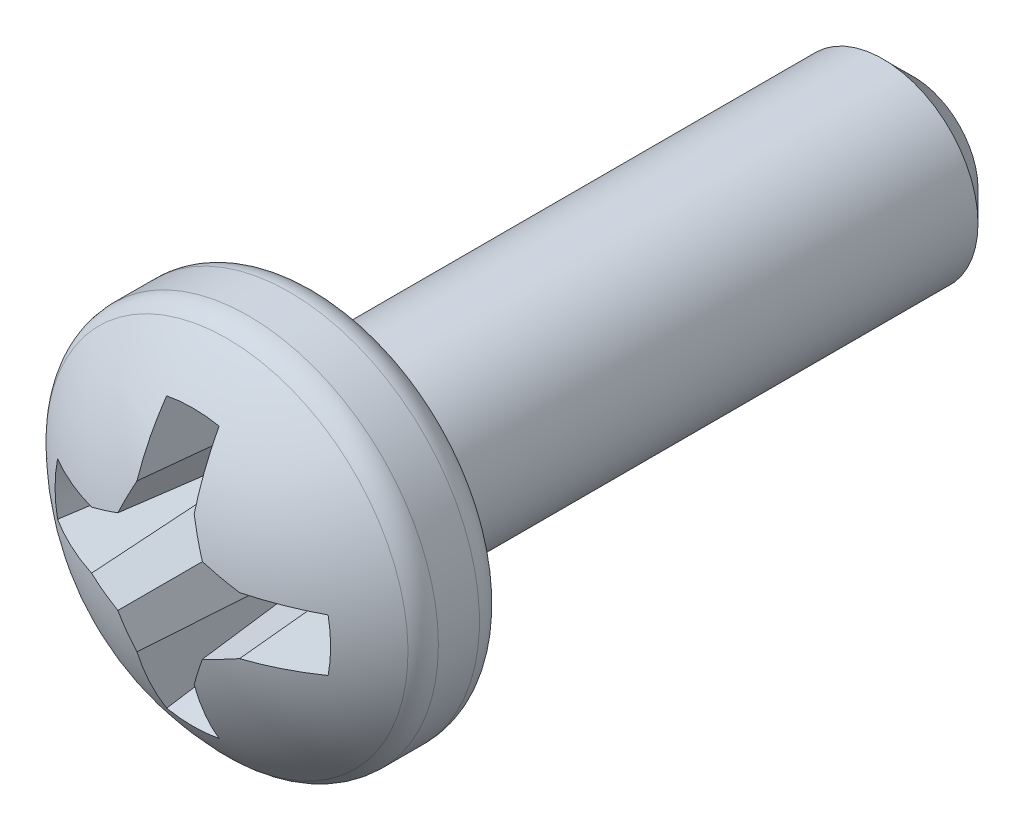
ISO-10303-21;
HEADER;
FILE_DESCRIPTION(('STEP AP214'),'2;1');
FILE_NAME('part.step','',(''),(''),'','','');
FILE_SCHEMA(('AUTOMOTIVE_DESIGN { 1 0 10303 214 1 1 1 1 }'));
ENDSEC;
DATA;
#1=APPLICATION_CONTEXT('core data for automotive mechanical design processes');
#2=APPLICATION_PROTOCOL_DEFINITION('international standard','automotive_design',2000,#1);
#3=PRODUCT_CONTEXT('',#1,'mechanical');
#4=PRODUCT('Part','Part','',(#3));
#5=PRODUCT_RELATED_PRODUCT_CATEGORY('part','',(#4));
#6=PRODUCT_DEFINITION_FORMATION('','',#4);
#7=PRODUCT_DEFINITION_CONTEXT('part definition',#1,'design');
#8=PRODUCT_DEFINITION('design','',#6,#7);
#9=PRODUCT_DEFINITION_SHAPE('','',#8);
#10=(LENGTH_UNIT() NAMED_UNIT(*) SI_UNIT(.MILLI.,.METRE.));
#11=(NAMED_UNIT(*) PLANE_ANGLE_UNIT() SI_UNIT($,.RADIAN.));
#12=(NAMED_UNIT(*) SI_UNIT($,.STERADIAN.) SOLID_ANGLE_UNIT());
#13=UNCERTAINTY_MEASURE_WITH_UNIT(LENGTH_MEASURE(1.E-05),#10,'distance_accuracy_value','');
#14=(GEOMETRIC_REPRESENTATION_CONTEXT(3) GLOBAL_UNCERTAINTY_ASSIGNED_CONTEXT((#13)) GLOBAL_UNIT_ASSIGNED_CONTEXT((#10,
#11,#12)) REPRESENTATION_CONTEXT('',''));
#15=CARTESIAN_POINT('',(0.,0.,0.));
#16=DIRECTION('',(0.,0.,1.));
#17=DIRECTION('',(1.,0.,0.));
#18=AXIS2_PLACEMENT_3D('',#15,#16,#17);
#19=CARTESIAN_POINT('',(0.319678325384203,0.791461441644268,0.413196607862429));
#20=DIRECTION('',(0.,0.,1.));
#21=DIRECTION('',(1.,0.,0.));
#22=AXIS2_PLACEMENT_3D('',#19,#20,#21);
#23=PLANE('',#22);
#24=DIRECTION('',(0.382683432365081,-0.92387953251129,0.));
#25=VECTOR('',#24,1.);
#26=CARTESIAN_POINT('',(0.332992212154071,0.796976234112247,0.413196607862429));
#27=LINE('',#26,#25);
#28=CARTESIAN_POINT('',(0.325421966738698,0.815252423264536,0.413196607862429));
#29=VERTEX_POINT('',#28);
#30=CARTESIAN_POINT('',(0.330707910320162,0.802491026580226,0.413196607862429));
#31=VERTEX_POINT('',#30);
#32=EDGE_CURVE('E292',#29,#31,#27,.T.);
#33=ORIENTED_EDGE('',*,*,#32,.F.);
#34=DIRECTION('',(0.,1.,0.));
#35=VECTOR('',#34,1.);
#36=CARTESIAN_POINT('',(0.325421966738698,0.791461441644268,0.413196607862429));
#37=LINE('',#36,#35);
#38=CARTESIAN_POINT('',(0.325421966738698,0.827667770310831,0.413196607862429));
#39=VERTEX_POINT('',#38);
#40=EDGE_CURVE('E168',#39,#29,#37,.F.);
#41=ORIENTED_EDGE('',*,*,#40,.F.);
#42=CARTESIAN_POINT('',(0.319678325384203,0.791461441644268,0.413196607862429));
#43=DIRECTION('',(0.,0.,1.));
#44=DIRECTION('',(1.,0.,0.));
#45=AXIS2_PLACEMENT_3D('',#42,#43,#44);
#46=CIRCLE('',#45,0.03665907324961);
#47=CARTESIAN_POINT('',(0.313934684029712,0.827667770310832,0.413196607862429));
#48=VERTEX_POINT('',#47);
#49=EDGE_CURVE('E159',#39,#48,#46,.T.);
#50=ORIENTED_EDGE('',*,*,#49,.T.);
#51=DIRECTION('',(0.,1.,0.));
#52=VECTOR('',#51,1.);
#53=CARTESIAN_POINT('',(0.313934684029713,0.791461441644271,0.413196607862429));
#54=LINE('',#53,#52);
#55=CARTESIAN_POINT('',(0.313934684029712,0.815252423264539,0.413196607862429));
#56=VERTEX_POINT('',#55);
#57=EDGE_CURVE('E166',#56,#48,#54,.T.);
#58=ORIENTED_EDGE('',*,*,#57,.F.);
#59=DIRECTION('',(0.382683432365079,0.923879532511291,0.));
#60=VECTOR('',#59,1.);
#61=CARTESIAN_POINT('',(0.306364438614338,0.79697623411225,0.413196607862429));
#62=LINE('',#61,#60);
#63=CARTESIAN_POINT('',(0.308648740448248,0.802491026580229,0.413196607862429));
#64=VERTEX_POINT('',#63);
#65=EDGE_CURVE('E301',#64,#56,#62,.T.);
#66=ORIENTED_EDGE('',*,*,#65,.F.);
#67=DIRECTION('',(0.923879532511289,0.382683432365086,0.));
#68=VECTOR('',#67,1.);
#69=CARTESIAN_POINT('',(0.314163532916228,0.804775328414139,0.413196607862429));
#70=LINE('',#69,#68);
#71=CARTESIAN_POINT('',(0.295887343763938,0.797205082998765,0.413196607862429));
#72=VERTEX_POINT('',#71);
#73=EDGE_CURVE('E307',#72,#64,#70,.T.);
#74=ORIENTED_EDGE('',*,*,#73,.F.);
#75=DIRECTION('',(1.,0.,0.));
#76=VECTOR('',#75,1.);
#77=CARTESIAN_POINT('',(0.319678325384207,0.797205082998765,0.413196607862429));
#78=LINE('',#77,#76);
#79=CARTESIAN_POINT('',(0.283471996676527,0.797205082997996,0.413196607853642));
#80=VERTEX_POINT('',#79);
#81=EDGE_CURVE('E313',#80,#72,#78,.T.);
#82=ORIENTED_EDGE('',*,*,#81,.F.);
#83=CARTESIAN_POINT('',(0.319678325384206,0.791461441644271,0.413196607862429));
#84=DIRECTION('',(0.,0.,1.));
#85=DIRECTION('',(1.,0.,0.));
#86=AXIS2_PLACEMENT_3D('',#83,#84,#85);
#87=CIRCLE('',#86,0.0366590732924525);
#88=CARTESIAN_POINT('',(0.283471996674264,0.78571780028978,0.413196607862429));
#89=VERTEX_POINT('',#88);
#90=EDGE_CURVE('E410',#80,#89,#87,.T.);
#91=ORIENTED_EDGE('',*,*,#90,.T.);
#92=DIRECTION('',(1.,0.,0.));
#93=VECTOR('',#92,1.);
#94=CARTESIAN_POINT('',(0.319678325384203,0.78571780028978,0.413196607862429));
#95=LINE('',#94,#93);
#96=CARTESIAN_POINT('',(0.295887343763935,0.78571780028978,0.413196607862429));
#97=VERTEX_POINT('',#96);
#98=EDGE_CURVE('E247',#97,#89,#95,.F.);
#99=ORIENTED_EDGE('',*,*,#98,.F.);
#100=DIRECTION('',(-0.923879532511292,0.382683432365076,0.));
#101=VECTOR('',#100,1.);
#102=CARTESIAN_POINT('',(0.314163532916224,0.778147554874406,0.413196607862429));
#103=LINE('',#102,#101);
#104=CARTESIAN_POINT('',(0.308648740448245,0.780431856708316,0.413196607862429));
#105=VERTEX_POINT('',#104);
#106=EDGE_CURVE('E248',#105,#97,#103,.T.);
#107=ORIENTED_EDGE('',*,*,#106,.F.);
#108=DIRECTION('',(-0.38268343236509,0.923879532511287,0.));
#109=VECTOR('',#108,1.);
#110=CARTESIAN_POINT('',(0.306364438614335,0.785946649176296,0.413196607862429));
#111=LINE('',#110,#109);
#112=CARTESIAN_POINT('',(0.31393468402971,0.767670460024005,0.413196607862429));
#113=VERTEX_POINT('',#112);
#114=EDGE_CURVE('E254',#113,#105,#111,.T.);
#115=ORIENTED_EDGE('',*,*,#114,.F.);
#116=DIRECTION('',(0.,1.,0.));
#117=VECTOR('',#116,1.);
#118=CARTESIAN_POINT('',(0.313934684029709,0.791461441644275,0.413196607862429));
#119=LINE('',#118,#117);
#120=CARTESIAN_POINT('',(0.31393468402971,0.755255112933514,0.413196607862429));
#121=VERTEX_POINT('',#120);
#122=EDGE_CURVE('E260',#121,#113,#119,.T.);
#123=ORIENTED_EDGE('',*,*,#122,.F.);
#124=CARTESIAN_POINT('',(0.319678325384204,0.791461441644275,0.413196607862429));
#125=DIRECTION('',(0.,0.,1.));
#126=DIRECTION('',(1.,0.,0.));
#127=AXIS2_PLACEMENT_3D('',#124,#125,#126);
#128=CIRCLE('',#127,0.0366590732932613);
#129=CARTESIAN_POINT('',(0.325421966738695,0.755255112933513,0.413196607862429));
#130=VERTEX_POINT('',#129);
#131=EDGE_CURVE('E336',#121,#130,#128,.T.);
#132=ORIENTED_EDGE('',*,*,#131,.T.);
#133=DIRECTION('',(0.,1.,0.));
#134=VECTOR('',#133,1.);
#135=CARTESIAN_POINT('',(0.325421966738694,0.791461441644272,0.413196607862429));
#136=LINE('',#135,#134);
#137=CARTESIAN_POINT('',(0.325421966738695,0.767670460024002,0.413196607862429));
#138=VERTEX_POINT('',#137);
#139=EDGE_CURVE('E266',#138,#130,#136,.F.);
#140=ORIENTED_EDGE('',*,*,#139,.F.);
#141=DIRECTION('',(-0.382683432365075,-0.923879532511293,0.));
#142=VECTOR('',#141,1.);
#143=CARTESIAN_POINT('',(0.332992212154069,0.785946649176293,0.413196607862429));
#144=LINE('',#143,#142);
#145=CARTESIAN_POINT('',(0.330707910320159,0.780431856708313,0.413196607862429));
#146=VERTEX_POINT('',#145);
#147=EDGE_CURVE('E267',#146,#138,#144,.T.);
#148=ORIENTED_EDGE('',*,*,#147,.F.);
#149=DIRECTION('',(-0.923879532511286,-0.382683432365092,0.));
#150=VECTOR('',#149,1.);
#151=CARTESIAN_POINT('',(0.325193117852179,0.778147554874402,0.413196607862429));
#152=LINE('',#151,#150);
#153=CARTESIAN_POINT('',(0.343469307004469,0.785717800289777,0.413196607862429));
#154=VERTEX_POINT('',#153);
#155=EDGE_CURVE('E273',#154,#146,#152,.T.);
#156=ORIENTED_EDGE('',*,*,#155,.F.);
#157=DIRECTION('',(1.,0.,0.));
#158=VECTOR('',#157,1.);
#159=CARTESIAN_POINT('',(0.3196783253842,0.785717800289777,0.413196607862429));
#160=LINE('',#159,#158);
#161=CARTESIAN_POINT('',(0.355884654050767,0.785717800289777,0.413196607862429));
#162=VERTEX_POINT('',#161);
#163=EDGE_CURVE('E279',#162,#154,#160,.F.);
#164=ORIENTED_EDGE('',*,*,#163,.F.);
#165=CARTESIAN_POINT('',(0.319678325384203,0.791461441644268,0.413196607862429));
#166=DIRECTION('',(0.,0.,1.));
#167=DIRECTION('',(1.,0.,0.));
#168=AXIS2_PLACEMENT_3D('',#165,#166,#167);
#169=CIRCLE('',#168,0.03665907324961);
#170=CARTESIAN_POINT('',(0.355884654050767,0.797205082998762,0.413196607862429));
#171=VERTEX_POINT('',#170);
#172=EDGE_CURVE('E492',#162,#171,#169,.T.);
#173=ORIENTED_EDGE('',*,*,#172,.T.);
#174=DIRECTION('',(1.,0.,0.));
#175=VECTOR('',#174,1.);
#176=CARTESIAN_POINT('',(0.319678325384203,0.797205082998762,0.413196607862429));
#177=LINE('',#176,#175);
#178=CARTESIAN_POINT('',(0.343469307004472,0.797205082998762,0.413196607862429));
#179=VERTEX_POINT('',#178);
#180=EDGE_CURVE('E285',#179,#171,#177,.T.);
#181=ORIENTED_EDGE('',*,*,#180,.F.);
#182=DIRECTION('',(0.92387953251129,-0.382683432365083,0.));
#183=VECTOR('',#182,1.);
#184=CARTESIAN_POINT('',(0.325193117852182,0.804775328414136,0.413196607862429));
#185=LINE('',#184,#183);
#186=EDGE_CURVE('E286',#31,#179,#185,.T.);
#187=ORIENTED_EDGE('',*,*,#186,.F.);
#188=EDGE_LOOP('',(#33,#41,#50,#58,#66,#74,#82,#91,#99,#107,#115,#123,#132,#140,#148,#156,#164,
#173,#181,#187));
#189=FACE_BOUND('',#188,.T.);
#190=ADVANCED_FACE('F17',(#189),#23,.T.);
#191=CARTESIAN_POINT('',(0.319678325384207,0.801303961329311,0.460047001563216));
#192=DIRECTION('',(0.,-0.996194698091744,0.0871557427476727));
#193=DIRECTION('',(0.,-0.0871557427476727,-0.996194698091744));
#194=AXIS2_PLACEMENT_3D('',#191,#192,#193);
#195=PLANE('',#194);
#196=DIRECTION('',(0.0173337504938649,-0.0871426484044457,-0.996045029063885));
#197=VECTOR('',#196,1.);
#198=CARTESIAN_POINT('',(0.295143943259578,0.8009424097128,0.455914447676356));
#199=LINE('',#198,#197);
#200=CARTESIAN_POINT('',(0.295143943259578,0.8009424097128,0.455914447676356));
#201=VERTEX_POINT('',#200);
#202=EDGE_CURVE('E310',#201,#72,#199,.T.);
#203=ORIENTED_EDGE('',*,*,#202,.F.);
#204=CARTESIAN_POINT('',(0.2748306923124,0.80015108887588,0.446869609122098));
#205=CARTESIAN_POINT('',(0.278019051995565,0.800321424804083,0.448816557690383));
#206=CARTESIAN_POINT('',(0.281306002749407,0.800472536171256,0.450543768520713));
#207=CARTESIAN_POINT('',(0.288077086398446,0.800736309783544,0.453558714705461));
#208=CARTESIAN_POINT('',(0.291561219293642,0.800848972028658,0.45484645005988));
#209=CARTESIAN_POINT('',(0.295143943259514,0.800942409712743,0.455914447676343));
#210=B_SPLINE_CURVE_WITH_KNOTS('',3,(#204,#205,#206,#207,#208,#209),.UNSPECIFIED.,.F.,.F.,(4,2,
4),(0.,0.011148597867128,0.022297195734256),.UNSPECIFIED.);
#211=CARTESIAN_POINT('',(0.274830692322977,0.800151088874493,0.446869609106245));
#212=VERTEX_POINT('',#211);
#213=EDGE_CURVE('E409',#212,#201,#210,.T.);
#214=ORIENTED_EDGE('',*,*,#213,.F.);
#215=CARTESIAN_POINT('',(0.274830692333555,0.800151088873107,0.446869609090391));
#216=CARTESIAN_POINT('',(0.276267160111317,0.79966000435443,0.441256487356838));
#217=CARTESIAN_POINT('',(0.277705502686871,0.799168961608414,0.435643843086986));
#218=CARTESIAN_POINT('',(0.280585937468524,0.798186959649785,0.424419509338453));
#219=CARTESIAN_POINT('',(0.282028029674714,0.797696000437175,0.418807819859794));
#220=CARTESIAN_POINT('',(0.283471996678788,0.797205082997228,0.413196607844861));
#221=B_SPLINE_CURVE_WITH_KNOTS('',3,(#215,#216,#217,#218,#219,#220),.UNSPECIFIED.,.F.,.F.,(4,2,
4),(0.,0.0174443558891328,0.0348887122017161),.UNSPECIFIED.);
#222=EDGE_CURVE('E318',#212,#80,#221,.T.);
#223=ORIENTED_EDGE('',*,*,#222,.T.);
#224=ORIENTED_EDGE('',*,*,#81,.T.);
#225=EDGE_LOOP('',(#203,#214,#223,#224));
#226=FACE_BOUND('',#225,.T.);
#227=ADVANCED_FACE('F427',(#226),#195,.T.);
#228=CARTESIAN_POINT('',(0.312594960087848,0.808562198209984,0.460047001563216));
#229=DIRECTION('',(0.381227206369649,-0.920363891963225,0.0871557427476661));
#230=DIRECTION('',(0.923879532511289,0.382683432365086,0.));
#231=AXIS2_PLACEMENT_3D('',#228,#229,#230);
#232=PLANE('',#231);
#233=DIRECTION('',(0.0666626913468198,-0.0666626913468417,-0.995546167269401));
#234=VECTOR('',#233,1.);
#235=CARTESIAN_POINT('',(0.305666961696687,0.805472805331791,0.457726739301586));
#236=LINE('',#235,#234);
#237=CARTESIAN_POINT('',(0.305666961696687,0.805472805331791,0.457726739301586));
#238=VERTEX_POINT('',#237);
#239=EDGE_CURVE('E304',#238,#64,#236,.T.);
#240=ORIENTED_EDGE('',*,*,#239,.F.);
#241=CARTESIAN_POINT('',(0.295143943259578,0.8009424097128,0.455914447676356));
#242=CARTESIAN_POINT('',(0.296874312814513,0.801700049456702,0.456346321822599));
#243=CARTESIAN_POINT('',(0.298616415795073,0.802456402296903,0.456713283197823));
#244=CARTESIAN_POINT('',(0.302124088607443,0.8039665341699,0.457317380406233));
#245=CARTESIAN_POINT('',(0.303889658439252,0.804720313202696,0.457554516239419));
#246=CARTESIAN_POINT('',(0.305666961696687,0.805472805331791,0.457726739301586));
#247=B_SPLINE_CURVE_WITH_KNOTS('',3,(#241,#242,#243,#244,#245,#246),.UNSPECIFIED.,.F.,.F.,(4,2,
4),(0.,0.00580300590917767,0.0116060118183555),.UNSPECIFIED.);
#248=EDGE_CURVE('E439',#201,#238,#247,.T.);
#249=ORIENTED_EDGE('',*,*,#248,.F.);
#250=ORIENTED_EDGE('',*,*,#202,.T.);
#251=ORIENTED_EDGE('',*,*,#73,.T.);
#252=EDGE_LOOP('',(#240,#249,#250,#251));
#253=FACE_BOUND('',#252,.T.);
#254=ADVANCED_FACE('F431',(#253),#232,.T.);
#255=CARTESIAN_POINT('',(0.302577568818494,0.79854480694063,0.460047001563216));
#256=DIRECTION('',(0.920363891963229,-0.381227206369643,0.0871557427476506));
#257=DIRECTION('',(0.382683432365079,0.923879532511291,0.));
#258=AXIS2_PLACEMENT_3D('',#255,#256,#257);
#259=PLANE('',#258);
#260=DIRECTION('',(0.0871426484044251,-0.0173337504938855,-0.996045029063886));
#261=VECTOR('',#260,1.);
#262=CARTESIAN_POINT('',(0.310197357315678,0.8159958237689,0.455914447676355));
#263=LINE('',#262,#261);
#264=CARTESIAN_POINT('',(0.310197357315678,0.8159958237689,0.455914447676355));
#265=VERTEX_POINT('',#264);
#266=EDGE_CURVE('E176',#265,#56,#263,.T.);
#267=ORIENTED_EDGE('',*,*,#266,.F.);
#268=CARTESIAN_POINT('',(0.305666961696687,0.805472805331791,0.457726739301586));
#269=CARTESIAN_POINT('',(0.306419453825782,0.807250108589226,0.457554516239419));
#270=CARTESIAN_POINT('',(0.307173232858578,0.809015678421036,0.457317380406232));
#271=CARTESIAN_POINT('',(0.308683364731575,0.812523351233405,0.456713283197822));
#272=CARTESIAN_POINT('',(0.309439717571776,0.814265454213965,0.456346321822598));
#273=CARTESIAN_POINT('',(0.310197357315678,0.8159958237689,0.455914447676355));
#274=B_SPLINE_CURVE_WITH_KNOTS('',3,(#268,#269,#270,#271,#272,#273),.UNSPECIFIED.,.F.,.F.,(4,2,
4),(0.,0.00580300590917782,0.0116060118183556),.UNSPECIFIED.);
#275=EDGE_CURVE('E445',#238,#265,#274,.T.);
#276=ORIENTED_EDGE('',*,*,#275,.F.);
#277=ORIENTED_EDGE('',*,*,#239,.T.);
#278=ORIENTED_EDGE('',*,*,#65,.T.);
#279=EDGE_LOOP('',(#267,#276,#277,#278));
#280=FACE_BOUND('',#279,.T.);
#281=ADVANCED_FACE('F436',(#280),#259,.T.);
#282=CARTESIAN_POINT('',(0.309835805699168,0.791461441644271,0.460047001563216));
#283=DIRECTION('',(0.996194698091747,0.,0.0871557427476441));
#284=DIRECTION('',(0.0871557427476441,0.,-0.996194698091747));
#285=AXIS2_PLACEMENT_3D('',#282,#283,#284);
#286=PLANE('',#285);
#287=CARTESIAN_POINT('',(0.313934684027908,0.827667770316141,0.413196607883054));
#288=CARTESIAN_POINT('',(0.313443766588118,0.82911173732706,0.418807819896191));
#289=CARTESIAN_POINT('',(0.312952807375665,0.83055382954012,0.424419509373048));
#290=CARTESIAN_POINT('',(0.311970805417353,0.833434264335565,0.435643843117971));
#291=CARTESIAN_POINT('',(0.311479762671496,0.834872606918041,0.441256487386014));
#292=CARTESIAN_POINT('',(0.310988678152978,0.836309074702749,0.446869609117753));
#293=B_SPLINE_CURVE_WITH_KNOTS('',3,(#287,#288,#289,#290,#291,#292),.UNSPECIFIED.,.F.,.F.,(4,2,
4),(0.,0.0174443563124399,0.0348887122014294),.UNSPECIFIED.);
#294=CARTESIAN_POINT('',(0.310988678153463,0.836309074701331,0.446869609112212));
#295=VERTEX_POINT('',#294);
#296=EDGE_CURVE('E170',#48,#295,#293,.T.);
#297=ORIENTED_EDGE('',*,*,#296,.T.);
#298=CARTESIAN_POINT('',(0.310197357315678,0.8159958237689,0.455914447676355));
#299=CARTESIAN_POINT('',(0.310290794999751,0.819578547733228,0.454846450060361));
#300=CARTESIAN_POINT('',(0.310403457244828,0.823062680626976,0.453558714706591));
#301=CARTESIAN_POINT('',(0.310667230856987,0.829833764273311,0.450543768523504));
#302=CARTESIAN_POINT('',(0.31081834222407,0.833120715025898,0.448816557694185));
#303=CARTESIAN_POINT('',(0.310988678152156,0.836309074707904,0.446869609127091));
#304=B_SPLINE_CURVE_WITH_KNOTS('',3,(#298,#299,#300,#301,#302,#303),.UNSPECIFIED.,.F.,.F.,(4,2,
4),(0.,0.0111485978623763,0.0222971957247527),.UNSPECIFIED.);
#305=EDGE_CURVE('E450',#265,#295,#304,.T.);
#306=ORIENTED_EDGE('',*,*,#305,.F.);
#307=ORIENTED_EDGE('',*,*,#266,.T.);
#308=ORIENTED_EDGE('',*,*,#57,.T.);
#309=EDGE_LOOP('',(#297,#306,#307,#308));
#310=FACE_BOUND('',#309,.T.);
#311=ADVANCED_FACE('F173',(#310),#286,.T.);
#312=CARTESIAN_POINT('',(0.319678325384203,0.791461441644268,0.44686960910667));
#313=DIRECTION('',(0.,0.,1.));
#314=DIRECTION('',(0.,-1.,0.));
#315=AXIS2_PLACEMENT_3D('',#312,#313,#314);
#316=CONICAL_SURFACE('',#315,0.0456817267589569,0.261799388331704);
#317=ORIENTED_EDGE('',*,*,#296,.F.);
#318=ORIENTED_EDGE('',*,*,#49,.F.);
#319=CARTESIAN_POINT('',(0.328367972616077,0.836309074704634,0.446869609125119));
#320=CARTESIAN_POINT('',(0.327876888097295,0.834872606919156,0.441256487390366));
#321=CARTESIAN_POINT('',(0.327385845351174,0.833434264335909,0.435643843119312));
#322=CARTESIAN_POINT('',(0.326403843392335,0.830553829538917,0.424419509368366));
#323=CARTESIAN_POINT('',(0.325912884179619,0.829111737325081,0.418807819888498));
#324=CARTESIAN_POINT('',(0.325421966739566,0.827667770313385,0.413196607872351));
#325=B_SPLINE_CURVE_WITH_KNOTS('',3,(#319,#320,#321,#322,#323,#324),.UNSPECIFIED.,.F.,.F.,(4,2,
4),(0.,0.0174443558983509,0.0348887122201521),.UNSPECIFIED.);
#326=CARTESIAN_POINT('',(0.328367972616216,0.836309074705281,0.446869609126709));
#327=VERTEX_POINT('',#326);
#328=EDGE_CURVE('E182',#327,#39,#325,.T.);
#329=ORIENTED_EDGE('',*,*,#328,.F.);
#330=CARTESIAN_POINT('',(0.319678325384203,0.791461441644268,0.44686960910667));
#331=DIRECTION('',(0.,0.,1.));
#332=DIRECTION('',(0.,-1.,0.));
#333=AXIS2_PLACEMENT_3D('',#330,#331,#332);
#334=CIRCLE('',#333,0.0456817267589569);
#335=EDGE_CURVE('E180',#295,#327,#334,.F.);
#336=ORIENTED_EDGE('',*,*,#335,.F.);
#337=EDGE_LOOP('',(#317,#318,#329,#336));
#338=FACE_BOUND('',#337,.T.);
#339=ADVANCED_FACE('F178',(#338),#316,.F.);
#340=CARTESIAN_POINT('',(0.329520845069243,0.791461441644268,0.460047001563216));
#341=DIRECTION('',(-0.996194698091746,0.,0.0871557427476584));
#342=DIRECTION('',(0.0871557427476584,0.,0.996194698091746));
#343=AXIS2_PLACEMENT_3D('',#340,#341,#342);
#344=PLANE('',#343);
#345=DIRECTION('',(-0.0871426484044379,-0.0173337504938648,-0.996045029063886));
#346=VECTOR('',#345,1.);
#347=CARTESIAN_POINT('',(0.329159293452732,0.815995823768896,0.455914447676356));
#348=LINE('',#347,#346);
#349=CARTESIAN_POINT('',(0.329159293452732,0.815995823768896,0.455914447676356));
#350=VERTEX_POINT('',#349);
#351=EDGE_CURVE('E295',#350,#29,#348,.T.);
#352=ORIENTED_EDGE('',*,*,#351,.F.);
#353=CARTESIAN_POINT('',(0.328367972616355,0.836309074705929,0.446869609128299));
#354=CARTESIAN_POINT('',(0.328538308544418,0.833120715024207,0.448816557695102));
#355=CARTESIAN_POINT('',(0.328689419911481,0.829833764271927,0.450543768524174));
#356=CARTESIAN_POINT('',(0.328953193523608,0.823062680626254,0.453558714706858));
#357=CARTESIAN_POINT('',(0.329065855768673,0.819578547732861,0.454846450060469));
#358=CARTESIAN_POINT('',(0.329159293452738,0.81599582376891,0.45591444767635));
#359=B_SPLINE_CURVE_WITH_KNOTS('',3,(#353,#354,#355,#356,#357,#358),.UNSPECIFIED.,.F.,.F.,(4,2,
4),(0.,0.0111485978612145,0.0222971957224289),.UNSPECIFIED.);
#360=EDGE_CURVE('E210',#327,#350,#359,.T.);
#361=ORIENTED_EDGE('',*,*,#360,.F.);
#362=ORIENTED_EDGE('',*,*,#328,.T.);
#363=ORIENTED_EDGE('',*,*,#40,.T.);
#364=EDGE_LOOP('',(#352,#361,#362,#363));
#365=FACE_BOUND('',#364,.T.);
#366=ADVANCED_FACE('F199',(#365),#344,.T.);
#367=CARTESIAN_POINT('',(0.336779081949916,0.798544806940627,0.460047001563216));
#368=DIRECTION('',(-0.920363891963228,-0.381227206369645,0.0871557427476584));
#369=DIRECTION('',(0.382683432365081,-0.92387953251129,0.));
#370=AXIS2_PLACEMENT_3D('',#367,#368,#369);
#371=PLANE('',#370);
#372=DIRECTION('',(-0.0666626913468198,-0.0666626913468417,-0.995546167269401));
#373=VECTOR('',#372,1.);
#374=CARTESIAN_POINT('',(0.333689689071723,0.805472805331788,0.457726739301586));
#375=LINE('',#374,#373);
#376=CARTESIAN_POINT('',(0.333689689071723,0.805472805331788,0.457726739301586));
#377=VERTEX_POINT('',#376);
#378=EDGE_CURVE('E289',#377,#31,#375,.T.);
#379=ORIENTED_EDGE('',*,*,#378,.F.);
#380=CARTESIAN_POINT('',(0.329159293452732,0.815995823768896,0.455914447676356));
#381=CARTESIAN_POINT('',(0.329916933196635,0.814265454213961,0.456346321822598));
#382=CARTESIAN_POINT('',(0.330673286036835,0.812523351233401,0.456713283197823));
#383=CARTESIAN_POINT('',(0.332183417909832,0.809015678421032,0.457317380406233));
#384=CARTESIAN_POINT('',(0.332937196942629,0.807250108589223,0.457554516239419));
#385=CARTESIAN_POINT('',(0.333689689071723,0.805472805331788,0.457726739301586));
#386=B_SPLINE_CURVE_WITH_KNOTS('',3,(#380,#381,#382,#383,#384,#385),.UNSPECIFIED.,.F.,.F.,(4,2,
4),(0.,0.00580300590917701,0.011606011818354),.UNSPECIFIED.);
#387=EDGE_CURVE('E218',#350,#377,#386,.T.);
#388=ORIENTED_EDGE('',*,*,#387,.F.);
#389=ORIENTED_EDGE('',*,*,#351,.T.);
#390=ORIENTED_EDGE('',*,*,#32,.T.);
#391=EDGE_LOOP('',(#379,#388,#389,#390));
#392=FACE_BOUND('',#391,.T.);
#393=ADVANCED_FACE('F204',(#392),#371,.T.);
#394=CARTESIAN_POINT('',(0.326761690680562,0.808562198209981,0.460047001563216));
#395=DIRECTION('',(-0.381227206369647,-0.920363891963227,0.0871557427476583));
#396=DIRECTION('',(0.92387953251129,-0.382683432365083,0.));
#397=AXIS2_PLACEMENT_3D('',#394,#395,#396);
#398=PLANE('',#397);
#399=DIRECTION('',(-0.0173337504938623,-0.0871426484044405,-0.996045029063885));
#400=VECTOR('',#399,1.);
#401=CARTESIAN_POINT('',(0.344212707508832,0.800942409712797,0.455914447676356));
#402=LINE('',#401,#400);
#403=CARTESIAN_POINT('',(0.344212707508832,0.800942409712797,0.455914447676356));
#404=VERTEX_POINT('',#403);
#405=EDGE_CURVE('E282',#404,#179,#402,.T.);
#406=ORIENTED_EDGE('',*,*,#405,.F.);
#407=CARTESIAN_POINT('',(0.333689689071723,0.805472805331788,0.457726739301586));
#408=CARTESIAN_POINT('',(0.335466992329158,0.804720313202693,0.457554516239419));
#409=CARTESIAN_POINT('',(0.337232562160967,0.803966534169897,0.457317380406233));
#410=CARTESIAN_POINT('',(0.340740234973337,0.8024564022969,0.456713283197822));
#411=CARTESIAN_POINT('',(0.342482337953897,0.801700049456699,0.456346321822598));
#412=CARTESIAN_POINT('',(0.344212707508832,0.800942409712797,0.455914447676355));
#413=B_SPLINE_CURVE_WITH_KNOTS('',3,(#407,#408,#409,#410,#411,#412),.UNSPECIFIED.,.F.,.F.,(4,2,
4),(0.,0.00580300590917776,0.0116060118183554),.UNSPECIFIED.);
#414=EDGE_CURVE('E462',#377,#404,#413,.T.);
#415=ORIENTED_EDGE('',*,*,#414,.F.);
#416=ORIENTED_EDGE('',*,*,#378,.T.);
#417=ORIENTED_EDGE('',*,*,#186,.T.);
#418=EDGE_LOOP('',(#406,#415,#416,#417));
#419=FACE_BOUND('',#418,.T.);
#420=ADVANCED_FACE('F474',(#419),#398,.T.);
#421=CARTESIAN_POINT('',(0.319678325384203,0.801303961329307,0.460047001563216));
#422=DIRECTION('',(0.,-0.996194698091746,0.0871557427476584));
#423=DIRECTION('',(0.,-0.0871557427476584,-0.996194698091746));
#424=AXIS2_PLACEMENT_3D('',#421,#422,#423);
#425=PLANE('',#424);
#426=CARTESIAN_POINT('',(0.35588465405595,0.797205083000523,0.413196607882565));
#427=CARTESIAN_POINT('',(0.357328621066889,0.797696000440321,0.418807819895783));
#428=CARTESIAN_POINT('',(0.358770713279971,0.79818695965278,0.424419509372721));
#429=CARTESIAN_POINT('',(0.361651148075457,0.799168961611107,0.435643843117808));
#430=CARTESIAN_POINT('',(0.363089490657954,0.799660004356971,0.441256487385932));
#431=CARTESIAN_POINT('',(0.364525958442683,0.800151088875497,0.446869609117753));
#432=B_SPLINE_CURVE_WITH_KNOTS('',3,(#426,#427,#428,#429,#430,#431),.UNSPECIFIED.,.F.,.F.,(4,2,
4),(0.,0.0174443563126935,0.0348887122019367),.UNSPECIFIED.);
#433=CARTESIAN_POINT('',(0.364525958441265,0.800151088875012,0.446869609112212));
#434=VERTEX_POINT('',#433);
#435=EDGE_CURVE('E351',#171,#434,#432,.T.);
#436=ORIENTED_EDGE('',*,*,#435,.T.);
#437=CARTESIAN_POINT('',(0.344212707508832,0.800942409712797,0.455914447676355));
#438=CARTESIAN_POINT('',(0.347795431473173,0.800848972028743,0.454846450060355));
#439=CARTESIAN_POINT('',(0.351279564366933,0.800736309783666,0.453558714706581));
#440=CARTESIAN_POINT('',(0.358050648013291,0.800472536171467,0.450543768523484));
#441=CARTESIAN_POINT('',(0.361337598765889,0.800321424804345,0.448816557694161));
#442=CARTESIAN_POINT('',(0.364525958447906,0.8001510888762,0.446869609127064));
#443=B_SPLINE_CURVE_WITH_KNOTS('',3,(#437,#438,#439,#440,#441,#442),.UNSPECIFIED.,.F.,.F.,(4,2,
4),(0.,0.011148597862416,0.0222971957248319),.UNSPECIFIED.);
#444=EDGE_CURVE('E463',#404,#434,#443,.T.);
#445=ORIENTED_EDGE('',*,*,#444,.F.);
#446=ORIENTED_EDGE('',*,*,#405,.T.);
#447=ORIENTED_EDGE('',*,*,#180,.T.);
#448=EDGE_LOOP('',(#436,#445,#446,#447));
#449=FACE_BOUND('',#448,.T.);
#450=ADVANCED_FACE('F477',(#449),#425,.T.);
#451=CARTESIAN_POINT('',(0.319678325384203,0.791461441644268,0.44686960910667));
#452=DIRECTION('',(0.,0.,1.));
#453=DIRECTION('',(0.,-1.,0.));
#454=AXIS2_PLACEMENT_3D('',#451,#452,#453);
#455=CONICAL_SURFACE('',#454,0.0456817267589569,0.261799388331704);
#456=ORIENTED_EDGE('',*,*,#172,.F.);
#457=CARTESIAN_POINT('',(0.36452595844457,0.782771794412398,0.446869609125119));
#458=CARTESIAN_POINT('',(0.363089490659071,0.783262878931187,0.441256487390285));
#459=CARTESIAN_POINT('',(0.361651148075803,0.783753921677315,0.435643843119149));
#460=CARTESIAN_POINT('',(0.358770713278769,0.784735923636168,0.42441950936804));
#461=CARTESIAN_POINT('',(0.357328621064912,0.785226882848891,0.418807819888091));
#462=CARTESIAN_POINT('',(0.355884654053195,0.785717800288952,0.413196607871862));
#463=B_SPLINE_CURVE_WITH_KNOTS('',3,(#457,#458,#459,#460,#461,#462),.UNSPECIFIED.,.F.,.F.,(4,2,
4),(0.,0.0174443558986039,0.0348887122206582),.UNSPECIFIED.);
#464=CARTESIAN_POINT('',(0.364525958445217,0.782771794412259,0.446869609126709));
#465=VERTEX_POINT('',#464);
#466=EDGE_CURVE('E346',#465,#162,#463,.T.);
#467=ORIENTED_EDGE('',*,*,#466,.F.);
#468=CARTESIAN_POINT('',(0.319678325384203,0.791461441644268,0.44686960910667));
#469=DIRECTION('',(0.,0.,1.));
#470=DIRECTION('',(0.,-1.,0.));
#471=AXIS2_PLACEMENT_3D('',#468,#469,#470);
#472=CIRCLE('',#471,0.0456817267589569);
#473=EDGE_CURVE('E464',#434,#465,#472,.F.);
#474=ORIENTED_EDGE('',*,*,#473,.F.);
#475=ORIENTED_EDGE('',*,*,#435,.F.);
#476=EDGE_LOOP('',(#456,#467,#474,#475));
#477=FACE_BOUND('',#476,.T.);
#478=ADVANCED_FACE('F482',(#477),#455,.F.);
#479=CARTESIAN_POINT('',(0.3196783253842,0.781618921959232,0.460047001563216));
#480=DIRECTION('',(0.,0.996194698091747,0.0871557427476441));
#481=DIRECTION('',(0.,-0.0871557427476441,0.996194698091747));
#482=AXIS2_PLACEMENT_3D('',#479,#480,#481);
#483=PLANE('',#482);
#484=DIRECTION('',(-0.0173337504938405,0.0871426484044261,-0.996045029063887));
#485=VECTOR('',#484,1.);
#486=CARTESIAN_POINT('',(0.344212707508828,0.781980473575742,0.455914447676357));
#487=LINE('',#486,#485);
#488=CARTESIAN_POINT('',(0.344212707508828,0.781980473575742,0.455914447676357));
#489=VERTEX_POINT('',#488);
#490=EDGE_CURVE('E276',#489,#154,#487,.T.);
#491=ORIENTED_EDGE('',*,*,#490,.F.);
#492=CARTESIAN_POINT('',(0.364525958445865,0.78277179441212,0.446869609128299));
#493=CARTESIAN_POINT('',(0.361337598764149,0.782601458484048,0.448816557695096));
#494=CARTESIAN_POINT('',(0.358050648011877,0.782450347116985,0.450543768524165));
#495=CARTESIAN_POINT('',(0.351279564366219,0.782186573504878,0.453558714706847));
#496=CARTESIAN_POINT('',(0.347795431472834,0.782073911259834,0.45484645006046));
#497=CARTESIAN_POINT('',(0.344212707508892,0.7819804735758,0.455914447676344));
#498=B_SPLINE_CURVE_WITH_KNOTS('',3,(#492,#493,#494,#495,#496,#497),.UNSPECIFIED.,.F.,.F.,(4,2,
4),(0.,0.0111485978611911,0.0222971957223823),.UNSPECIFIED.);
#499=EDGE_CURVE('E509',#465,#489,#498,.T.);
#500=ORIENTED_EDGE('',*,*,#499,.F.);
#501=ORIENTED_EDGE('',*,*,#466,.T.);
#502=ORIENTED_EDGE('',*,*,#163,.T.);
#503=EDGE_LOOP('',(#491,#500,#501,#502));
#504=FACE_BOUND('',#503,.T.);
#505=ADVANCED_FACE('F499',(#504),#483,.T.);
#506=CARTESIAN_POINT('',(0.326761690680559,0.774360685078558,0.460047001563216));
#507=DIRECTION('',(-0.381227206369656,0.920363891963225,0.0871557427476397));
#508=DIRECTION('',(-0.923879532511286,-0.382683432365092,0.));
#509=AXIS2_PLACEMENT_3D('',#506,#507,#508);
#510=PLANE('',#509);
#511=DIRECTION('',(-0.0666626913468182,0.0666626913468194,-0.995546167269403));
#512=VECTOR('',#511,1.);
#513=CARTESIAN_POINT('',(0.33368968907172,0.777450077956752,0.457726739301588));
#514=LINE('',#513,#512);
#515=CARTESIAN_POINT('',(0.33368968907172,0.777450077956752,0.457726739301588));
#516=VERTEX_POINT('',#515);
#517=EDGE_CURVE('E270',#516,#146,#514,.T.);
#518=ORIENTED_EDGE('',*,*,#517,.F.);
#519=CARTESIAN_POINT('',(0.344212707508828,0.781980473575742,0.455914447676357));
#520=CARTESIAN_POINT('',(0.342482337953893,0.781222833831839,0.4563463218226));
#521=CARTESIAN_POINT('',(0.340740234973334,0.780466480991639,0.456713283197824));
#522=CARTESIAN_POINT('',(0.337232562160965,0.778956349118642,0.457317380406234));
#523=CARTESIAN_POINT('',(0.335466992329155,0.778202570085846,0.45755451623942));
#524=CARTESIAN_POINT('',(0.33368968907172,0.777450077956751,0.457726739301587));
#525=B_SPLINE_CURVE_WITH_KNOTS('',3,(#519,#520,#521,#522,#523,#524),.UNSPECIFIED.,.F.,.F.,(4,2,
4),(0.,0.00580300590917719,0.0116060118183543),.UNSPECIFIED.);
#526=EDGE_CURVE('E515',#489,#516,#525,.T.);
#527=ORIENTED_EDGE('',*,*,#526,.F.);
#528=ORIENTED_EDGE('',*,*,#490,.T.);
#529=ORIENTED_EDGE('',*,*,#155,.T.);
#530=EDGE_LOOP('',(#518,#527,#528,#529));
#531=FACE_BOUND('',#530,.T.);
#532=ADVANCED_FACE('F503',(#531),#510,.T.);
#533=CARTESIAN_POINT('',(0.336779081949913,0.784378076347913,0.460047001563216));
#534=DIRECTION('',(-0.920363891963232,0.381227206369639,0.0871557427476397));
#535=DIRECTION('',(-0.382683432365075,-0.923879532511293,0.));
#536=AXIS2_PLACEMENT_3D('',#533,#534,#535);
#537=PLANE('',#536);
#538=DIRECTION('',(-0.0871426484044248,0.0173337504938367,-0.996045029063887));
#539=VECTOR('',#538,1.);
#540=CARTESIAN_POINT('',(0.329159293452729,0.766927059519643,0.455914447676357));
#541=LINE('',#540,#539);
#542=CARTESIAN_POINT('',(0.329159293452729,0.766927059519643,0.455914447676357));
#543=VERTEX_POINT('',#542);
#544=EDGE_CURVE('E263',#543,#138,#541,.T.);
#545=ORIENTED_EDGE('',*,*,#544,.F.);
#546=CARTESIAN_POINT('',(0.33368968907172,0.777450077956752,0.457726739301587));
#547=CARTESIAN_POINT('',(0.332937196942626,0.775672774699317,0.45755451623942));
#548=CARTESIAN_POINT('',(0.332183417909829,0.773907204867507,0.457317380406234));
#549=CARTESIAN_POINT('',(0.330673286036832,0.770399532055138,0.456713283197824));
#550=CARTESIAN_POINT('',(0.329916933196632,0.768657429074578,0.4563463218226));
#551=CARTESIAN_POINT('',(0.329159293452729,0.766927059519643,0.455914447676357));
#552=B_SPLINE_CURVE_WITH_KNOTS('',3,(#546,#547,#548,#549,#550,#551),.UNSPECIFIED.,.F.,.F.,(4,2,
4),(0.,0.00580300590917765,0.0116060118183553),.UNSPECIFIED.);
#553=EDGE_CURVE('E535',#516,#543,#552,.T.);
#554=ORIENTED_EDGE('',*,*,#553,.F.);
#555=ORIENTED_EDGE('',*,*,#517,.T.);
#556=ORIENTED_EDGE('',*,*,#147,.T.);
#557=EDGE_LOOP('',(#545,#554,#555,#556));
#558=FACE_BOUND('',#557,.T.);
#559=ADVANCED_FACE('F548',(#558),#537,.T.);
#560=CARTESIAN_POINT('',(0.329520845069239,0.791461441644272,0.460047001563216));
#561=DIRECTION('',(-0.996194698091747,0.,0.0871557427476441));
#562=DIRECTION('',(0.0871557427476441,0.,0.996194698091747));
#563=AXIS2_PLACEMENT_3D('',#560,#561,#562);
#564=PLANE('',#563);
#565=CARTESIAN_POINT('',(0.325421966734214,0.755255112940341,0.413196607846537));
#566=CARTESIAN_POINT('',(0.325912884176397,0.753811145925846,0.418807819869363));
#567=CARTESIAN_POINT('',(0.326403843390741,0.752369053709636,0.424419509356063));
#568=CARTESIAN_POINT('',(0.327385845351832,0.749488618908748,0.435643843120978));
#569=CARTESIAN_POINT('',(0.327876888098578,0.748050276323978,0.441256487399171));
#570=CARTESIAN_POINT('',(0.328367972617482,0.746613808537403,0.446869609141214));
#571=B_SPLINE_CURVE_WITH_KNOTS('',3,(#565,#566,#567,#568,#569,#570),.UNSPECIFIED.,.F.,.F.,(4,2,
4),(0.,0.0174443563437593,0.0348887122640674),.UNSPECIFIED.);
#572=CARTESIAN_POINT('',(0.328367972618458,0.746613808534548,0.446869609152369));
#573=VERTEX_POINT('',#572);
#574=EDGE_CURVE('E559',#130,#573,#571,.T.);
#575=ORIENTED_EDGE('',*,*,#574,.T.);
#576=CARTESIAN_POINT('',(0.329159293452729,0.766927059519643,0.455914447676357));
#577=CARTESIAN_POINT('',(0.329065855768619,0.763344335553898,0.454846450059938));
#578=CARTESIAN_POINT('',(0.328953193523491,0.759860202658822,0.453558714705578));
#579=CARTESIAN_POINT('',(0.328689419911199,0.753089119010007,0.450543768520974));
#580=CARTESIAN_POINT('',(0.328538308544035,0.749802168256268,0.448816557690731));
#581=CARTESIAN_POINT('',(0.328367972615854,0.746613808573199,0.446869609122547));
#582=B_SPLINE_CURVE_WITH_KNOTS('',3,(#576,#577,#578,#579,#580,#581),.UNSPECIFIED.,.F.,.F.,(4,2,
4),(0.,0.0111485978667313,0.0222971957334626),.UNSPECIFIED.);
#583=EDGE_CURVE('E536',#543,#573,#582,.T.);
#584=ORIENTED_EDGE('',*,*,#583,.F.);
#585=ORIENTED_EDGE('',*,*,#544,.T.);
#586=ORIENTED_EDGE('',*,*,#139,.T.);
#587=EDGE_LOOP('',(#575,#584,#585,#586));
#588=FACE_BOUND('',#587,.T.);
#589=ADVANCED_FACE('F551',(#588),#564,.T.);
#590=CARTESIAN_POINT('',(0.319678325384204,0.791461441644275,0.446869609163513));
#591=DIRECTION('',(0.,0.,1.));
#592=DIRECTION('',(1.,0.,0.));
#593=AXIS2_PLACEMENT_3D('',#590,#591,#592);
#594=CONICAL_SURFACE('',#593,0.0456817268157992,0.26179938827518);
#595=ORIENTED_EDGE('',*,*,#131,.F.);
#596=CARTESIAN_POINT('',(0.310988678164369,0.746613808550998,0.446869609129761));
#597=CARTESIAN_POINT('',(0.311479762677388,0.74805027633218,0.441256487389753));
#598=CARTESIAN_POINT('',(0.311970805419769,0.749488618912762,0.435643843114038));
#599=CARTESIAN_POINT('',(0.312952807375171,0.752369053707687,0.424419509354961));
#600=CARTESIAN_POINT('',(0.31344376658819,0.75381114592212,0.418807819871623));
#601=CARTESIAN_POINT('',(0.31393468403057,0.755255112936044,0.4131966078526));
#602=B_SPLINE_CURVE_WITH_KNOTS('',3,(#596,#597,#598,#599,#600,#601),.UNSPECIFIED.,.F.,.F.,(4,2,
4),(0.,0.0174443559089221,0.0348887122412915),.UNSPECIFIED.);
#603=CARTESIAN_POINT('',(0.310988678152353,0.74661380855802,0.446869609124863));
#604=VERTEX_POINT('',#603);
#605=EDGE_CURVE('E331',#604,#121,#602,.T.);
#606=ORIENTED_EDGE('',*,*,#605,.F.);
#607=CARTESIAN_POINT('',(0.319678325384204,0.791461441644275,0.446869609163513));
#608=DIRECTION('',(0.,0.,1.));
#609=DIRECTION('',(1.,0.,0.));
#610=AXIS2_PLACEMENT_3D('',#607,#608,#609);
#611=CIRCLE('',#610,0.0456817268157992);
#612=EDGE_CURVE('E538',#573,#604,#611,.F.);
#613=ORIENTED_EDGE('',*,*,#612,.F.);
#614=ORIENTED_EDGE('',*,*,#574,.F.);
#615=EDGE_LOOP('',(#595,#606,#613,#614));
#616=FACE_BOUND('',#615,.T.);
#617=ADVANCED_FACE('F555',(#616),#594,.F.);
#618=CARTESIAN_POINT('',(0.309835805699164,0.791461441644275,0.460047001563216));
#619=DIRECTION('',(0.996194698091746,0.,0.0871557427476584));
#620=DIRECTION('',(0.0871557427476584,0.,-0.996194698091746));
#621=AXIS2_PLACEMENT_3D('',#618,#619,#620);
#622=PLANE('',#621);
#623=DIRECTION('',(0.0871426484044388,0.0173337504938311,-0.996045029063886));
#624=VECTOR('',#623,1.);
#625=CARTESIAN_POINT('',(0.310197357315675,0.766927059519646,0.455914447676358));
#626=LINE('',#625,#624);
#627=CARTESIAN_POINT('',(0.310197357315675,0.766927059519647,0.455914447676358));
#628=VERTEX_POINT('',#627);
#629=EDGE_CURVE('E257',#628,#113,#626,.T.);
#630=ORIENTED_EDGE('',*,*,#629,.F.);
#631=CARTESIAN_POINT('',(0.31098867815247,0.746613808574793,0.446869609123522));
#632=CARTESIAN_POINT('',(0.310818342224307,0.749802168257633,0.448816557691471));
#633=CARTESIAN_POINT('',(0.310667230857159,0.753089119011123,0.450543768521515));
#634=CARTESIAN_POINT('',(0.310403457244892,0.759860202659403,0.453558714705792));
#635=CARTESIAN_POINT('',(0.310290794999773,0.763344335554192,0.454846450060025));
#636=CARTESIAN_POINT('',(0.310197357315669,0.766927059519632,0.455914447676352));
#637=B_SPLINE_CURVE_WITH_KNOTS('',3,(#631,#632,#633,#634,#635,#636),.UNSPECIFIED.,.F.,.F.,(4,2,
4),(0.,0.0111485978657917,0.0222971957315836),.UNSPECIFIED.);
#638=EDGE_CURVE('E574',#604,#628,#637,.T.);
#639=ORIENTED_EDGE('',*,*,#638,.F.);
#640=ORIENTED_EDGE('',*,*,#605,.T.);
#641=ORIENTED_EDGE('',*,*,#122,.T.);
#642=EDGE_LOOP('',(#630,#639,#640,#641));
#643=FACE_BOUND('',#642,.T.);
#644=ADVANCED_FACE('F582',(#643),#622,.T.);
#645=CARTESIAN_POINT('',(0.302577568818491,0.784378076347916,0.460047001563216));
#646=DIRECTION('',(0.920363891963225,0.381227206369654,0.0871557427476474));
#647=DIRECTION('',(-0.38268343236509,0.923879532511287,0.));
#648=AXIS2_PLACEMENT_3D('',#645,#646,#647);
#649=PLANE('',#648);
#650=DIRECTION('',(0.0666626913468231,0.0666626913468074,-0.995546167269403));
#651=VECTOR('',#650,1.);
#652=CARTESIAN_POINT('',(0.305666961696684,0.777450077956755,0.457726739301588));
#653=LINE('',#652,#651);
#654=CARTESIAN_POINT('',(0.305666961696684,0.777450077956755,0.457726739301588));
#655=VERTEX_POINT('',#654);
#656=EDGE_CURVE('E251',#655,#105,#653,.T.);
#657=ORIENTED_EDGE('',*,*,#656,.F.);
#658=CARTESIAN_POINT('',(0.310197357315675,0.766927059519647,0.455914447676357));
#659=CARTESIAN_POINT('',(0.309439717571772,0.768657429074581,0.4563463218226));
#660=CARTESIAN_POINT('',(0.308683364731572,0.770399532055141,0.456713283197824));
#661=CARTESIAN_POINT('',(0.307173232858575,0.773907204867511,0.457317380406234));
#662=CARTESIAN_POINT('',(0.306419453825779,0.77567277469932,0.45755451623942));
#663=CARTESIAN_POINT('',(0.305666961696684,0.777450077956755,0.457726739301587));
#664=B_SPLINE_CURVE_WITH_KNOTS('',3,(#658,#659,#660,#661,#662,#663),.UNSPECIFIED.,.F.,.F.,(4,2,
4),(0.,0.0058030059091775,0.0116060118183551),.UNSPECIFIED.);
#665=EDGE_CURVE('E575',#628,#655,#664,.T.);
#666=ORIENTED_EDGE('',*,*,#665,.F.);
#667=ORIENTED_EDGE('',*,*,#629,.T.);
#668=ORIENTED_EDGE('',*,*,#114,.T.);
#669=EDGE_LOOP('',(#657,#666,#667,#668));
#670=FACE_BOUND('',#669,.T.);
#671=ADVANCED_FACE('F585',(#670),#649,.T.);
#672=CARTESIAN_POINT('',(0.312594960087845,0.774360685078562,0.460047001563217));
#673=DIRECTION('',(0.381227206369641,0.920363891963232,0.0871557427476319));
#674=DIRECTION('',(-0.923879532511292,0.382683432365076,0.));
#675=AXIS2_PLACEMENT_3D('',#672,#673,#674);
#676=PLANE('',#675);
#677=DIRECTION('',(0.017333750493862,0.0871426484044134,-0.996045029063888));
#678=VECTOR('',#677,1.);
#679=CARTESIAN_POINT('',(0.295143943259575,0.781980473575746,0.455914447676357));
#680=LINE('',#679,#678);
#681=CARTESIAN_POINT('',(0.295143943259575,0.781980473575746,0.455914447676357));
#682=VERTEX_POINT('',#681);
#683=EDGE_CURVE('E244',#682,#97,#680,.T.);
#684=ORIENTED_EDGE('',*,*,#683,.F.);
#685=CARTESIAN_POINT('',(0.305666961696684,0.777450077956755,0.457726739301587));
#686=CARTESIAN_POINT('',(0.303889658439249,0.778202570085849,0.45755451623942));
#687=CARTESIAN_POINT('',(0.30212408860744,0.778956349118646,0.457317380406234));
#688=CARTESIAN_POINT('',(0.29861641579507,0.780466480991643,0.456713283197824));
#689=CARTESIAN_POINT('',(0.29687431281451,0.781222833831843,0.456346321822599));
#690=CARTESIAN_POINT('',(0.295143943259575,0.781980473575746,0.455914447676356));
#691=B_SPLINE_CURVE_WITH_KNOTS('',3,(#685,#686,#687,#688,#689,#690),.UNSPECIFIED.,.F.,.F.,(4,2,
4),(0.,0.00580300590917783,0.0116060118183555),.UNSPECIFIED.);
#692=EDGE_CURVE('E388',#655,#682,#691,.T.);
#693=ORIENTED_EDGE('',*,*,#692,.F.);
#694=ORIENTED_EDGE('',*,*,#656,.T.);
#695=ORIENTED_EDGE('',*,*,#106,.T.);
#696=EDGE_LOOP('',(#684,#693,#694,#695));
#697=FACE_BOUND('',#696,.T.);
#698=ADVANCED_FACE('F397',(#697),#676,.T.);
#699=CARTESIAN_POINT('',(0.319678325384203,0.781618921959236,0.460047001563216));
#700=DIRECTION('',(0.,0.996194698091748,0.0871557427476297));
#701=DIRECTION('',(0.,-0.0871557427476297,0.996194698091748));
#702=AXIS2_PLACEMENT_3D('',#699,#700,#701);
#703=PLANE('',#702);
#704=CARTESIAN_POINT('',(0.283471996681595,0.785717800294765,0.413196607846229));
#705=CARTESIAN_POINT('',(0.28202802967609,0.785226882853084,0.418807819860586));
#706=CARTESIAN_POINT('',(0.28058593746895,0.78473592363932,0.424419509338842));
#707=CARTESIAN_POINT('',(0.277705502686361,0.783753921679543,0.43564384308692));
#708=CARTESIAN_POINT('',(0.276267160110821,0.783262878933532,0.441256487356718));
#709=CARTESIAN_POINT('',(0.274830692333554,0.782771794415439,0.446869609090392));
#710=B_SPLINE_CURVE_WITH_KNOTS('',3,(#704,#705,#706,#707,#708,#709),.UNSPECIFIED.,.F.,.F.,(4,2,
4),(0.,0.0174443563124173,0.0348887122013833),.UNSPECIFIED.);
#711=CARTESIAN_POINT('',(0.274830692338746,0.782771794417214,0.446869609070109));
#712=VERTEX_POINT('',#711);
#713=EDGE_CURVE('E403',#89,#712,#710,.T.);
#714=ORIENTED_EDGE('',*,*,#713,.T.);
#715=CARTESIAN_POINT('',(0.295143943259575,0.781980473575746,0.455914447676356));
#716=CARTESIAN_POINT('',(0.291561219293681,0.782073911259841,0.454846450059891));
#717=CARTESIAN_POINT('',(0.288077086398465,0.782186573504974,0.453558714705468));
#718=CARTESIAN_POINT('',(0.281306002749389,0.782450347117318,0.450543768520709));
#719=CARTESIAN_POINT('',(0.278019051995528,0.782601458484529,0.448816557690372));
#720=CARTESIAN_POINT('',(0.274830692312346,0.782771794412779,0.446869609122079));
#721=B_SPLINE_CURVE_WITH_KNOTS('',3,(#715,#716,#717,#718,#719,#720),.UNSPECIFIED.,.F.,.F.,(4,2,
4),(0.,0.0111485978671902,0.0222971957343805),.UNSPECIFIED.);
#722=EDGE_CURVE('E382',#682,#712,#721,.T.);
#723=ORIENTED_EDGE('',*,*,#722,.F.);
#724=ORIENTED_EDGE('',*,*,#683,.T.);
#725=ORIENTED_EDGE('',*,*,#98,.T.);
#726=EDGE_LOOP('',(#714,#723,#724,#725));
#727=FACE_BOUND('',#726,.T.);
#728=ADVANCED_FACE('F394',(#727),#703,.T.);
#729=CARTESIAN_POINT('',(0.319678325384207,0.791461441644271,0.446869608879295));
#730=DIRECTION('',(0.,0.,1.));
#731=DIRECTION('',(0.,-1.,0.));
#732=AXIS2_PLACEMENT_3D('',#729,#730,#731);
#733=CONICAL_SURFACE('',#732,0.0456817266972227,0.261799387122199);
#734=ORIENTED_EDGE('',*,*,#90,.F.);
#735=ORIENTED_EDGE('',*,*,#222,.F.);
#736=CARTESIAN_POINT('',(0.319678325384207,0.791461441644271,0.446869609049826));
#737=DIRECTION('',(0.,0.,1.));
#738=DIRECTION('',(0.,-1.,0.));
#739=AXIS2_PLACEMENT_3D('',#736,#737,#738);
#740=CIRCLE('',#739,0.0456817267429161);
#741=EDGE_CURVE('E380',#712,#212,#740,.F.);
#742=ORIENTED_EDGE('',*,*,#741,.F.);
#743=ORIENTED_EDGE('',*,*,#713,.F.);
#744=EDGE_LOOP('',(#734,#735,#742,#743));
#745=FACE_BOUND('',#744,.T.);
#746=ADVANCED_FACE('F231',(#745),#733,.F.);
#747=CARTESIAN_POINT('',(0.319678325384203,0.791461441644268,0.374276472879301));
#748=DIRECTION('',(1.,0.,0.));
#749=DIRECTION('',(0.,1.,0.));
#750=AXIS2_PLACEMENT_3D('',#747,#748,#749);
#751=SPHERICAL_SURFACE('',#750,0.0857705286839147);
#752=ORIENTED_EDGE('',*,*,#444,.T.);
#753=ORIENTED_EDGE('',*,*,#473,.T.);
#754=ORIENTED_EDGE('',*,*,#499,.T.);
#755=ORIENTED_EDGE('',*,*,#526,.T.);
#756=ORIENTED_EDGE('',*,*,#553,.T.);
#757=ORIENTED_EDGE('',*,*,#583,.T.);
#758=ORIENTED_EDGE('',*,*,#612,.T.);
#759=ORIENTED_EDGE('',*,*,#638,.T.);
#760=ORIENTED_EDGE('',*,*,#665,.T.);
#761=ORIENTED_EDGE('',*,*,#692,.T.);
#762=ORIENTED_EDGE('',*,*,#722,.T.);
#763=ORIENTED_EDGE('',*,*,#741,.T.);
#764=ORIENTED_EDGE('',*,*,#213,.T.);
#765=ORIENTED_EDGE('',*,*,#248,.T.);
#766=ORIENTED_EDGE('',*,*,#275,.T.);
#767=ORIENTED_EDGE('',*,*,#305,.T.);
#768=ORIENTED_EDGE('',*,*,#335,.T.);
#769=ORIENTED_EDGE('',*,*,#360,.T.);
#770=ORIENTED_EDGE('',*,*,#387,.T.);
#771=ORIENTED_EDGE('',*,*,#414,.T.);
#772=EDGE_LOOP('',(#752,#753,#754,#755,#756,#757,#758,#759,#760,#761,#762,#763,#764,#765,#766,
#767,#768,#769,#770,#771));
#773=FACE_BOUND('',#772,.T.);
#774=CARTESIAN_POINT('',(0.319678325384203,0.791461441644267,0.435555053516584));
#775=DIRECTION('',(0.,0.,-1.));
#776=DIRECTION('',(0.,1.,0.));
#777=AXIS2_PLACEMENT_3D('',#774,#775,#776);
#778=CIRCLE('',#777,0.0600126582130671);
#779=CARTESIAN_POINT('',(0.319678325384203,0.851474099857334,0.435555053516583));
#780=VERTEX_POINT('',#779);
#781=EDGE_CURVE('E376',#780,#780,#778,.T.);
#782=ORIENTED_EDGE('',*,*,#781,.F.);
#783=EDGE_LOOP('',(#782));
#784=FACE_BOUND('',#783,.T.);
#785=ADVANCED_FACE('F224',(#773,#784),#751,.T.);
#786=CARTESIAN_POINT('',(0.319678325384203,0.791461441644267,0.428466829500573));
#787=DIRECTION('',(0.,0.,-1.));
#788=DIRECTION('',(0.,1.,0.));
#789=AXIS2_PLACEMENT_3D('',#786,#787,#788);
#790=TOROIDAL_SURFACE('',#789,0.0530708661417328,0.00992125984251978);
#791=ORIENTED_EDGE('',*,*,#781,.T.);
#792=EDGE_LOOP('',(#791));
#793=FACE_BOUND('',#792,.T.);
#794=CARTESIAN_POINT('',(0.319678325384203,0.791461441644268,0.428466829500572));
#795=DIRECTION('',(0.,0.,1.));
#796=DIRECTION('',(1.,0.,0.));
#797=AXIS2_PLACEMENT_3D('',#794,#795,#796);
#798=CIRCLE('',#797,0.0629921259842517);
#799=CARTESIAN_POINT('',(0.382670451368455,0.791461441644268,0.428466829500572));
#800=VERTEX_POINT('',#799);
#801=EDGE_CURVE('E379',#800,#800,#798,.F.);
#802=ORIENTED_EDGE('',*,*,#801,.F.);
#803=EDGE_LOOP('',(#802));
#804=FACE_BOUND('',#803,.T.);
#805=ADVANCED_FACE('F230',(#793,#804),#790,.T.);
#806=CARTESIAN_POINT('',(0.319678325384203,0.791461441644268,0.208078497626208));
#807=DIRECTION('',(0.,0.,1.));
#808=DIRECTION('',(1.,0.,0.));
#809=AXIS2_PLACEMENT_3D('',#806,#807,#808);
#810=CYLINDRICAL_SURFACE('',#809,0.0629921259842517);
#811=ORIENTED_EDGE('',*,*,#801,.T.);
#812=EDGE_LOOP('',(#811));
#813=FACE_BOUND('',#812,.T.);
#814=CARTESIAN_POINT('',(0.319678325384203,0.791461441644267,0.414850151169516));
#815=DIRECTION('',(0.,0.,-1.));
#816=DIRECTION('',(0.,1.,0.));
#817=AXIS2_PLACEMENT_3D('',#814,#815,#816);
#818=CIRCLE('',#817,0.0629921259842528);
#819=CARTESIAN_POINT('',(0.319678325384203,0.85445356762852,0.414850151169515));
#820=VERTEX_POINT('',#819);
#821=EDGE_CURVE('E639',#820,#820,#818,.T.);
#822=ORIENTED_EDGE('',*,*,#821,.F.);
#823=EDGE_LOOP('',(#822));
#824=FACE_BOUND('',#823,.T.);
#825=ADVANCED_FACE('F634',(#813,#824),#810,.T.);
#826=CARTESIAN_POINT('',(0.319678325384203,0.791461441644267,0.414850151169516));
#827=DIRECTION('',(0.,0.,-1.));
#828=DIRECTION('',(0.,1.,0.));
#829=AXIS2_PLACEMENT_3D('',#826,#827,#828);
#830=TOROIDAL_SURFACE('',#829,0.053070866141733,0.00992125984251974);
#831=CARTESIAN_POINT('',(0.319678325384203,0.791461441644267,0.404928891326996));
#832=DIRECTION('',(0.,0.,1.));
#833=DIRECTION('',(0.,-1.,0.));
#834=AXIS2_PLACEMENT_3D('',#831,#832,#833);
#835=CIRCLE('',#834,0.053070866141733);
#836=CARTESIAN_POINT('',(0.319678325384203,0.844532307786,0.404928891326996));
#837=VERTEX_POINT('',#836);
#838=CARTESIAN_POINT('',(0.319678325384203,0.738390575502534,0.404928891326997));
#839=VERTEX_POINT('',#838);
#840=EDGE_CURVE('E646',#837,#839,#835,.F.);
#841=ORIENTED_EDGE('',*,*,#840,.F.);
#842=CARTESIAN_POINT('',(0.319678325384203,0.791461441644267,0.404928891326996));
#843=DIRECTION('',(0.,0.,1.));
#844=DIRECTION('',(0.,1.,0.));
#845=AXIS2_PLACEMENT_3D('',#842,#843,#844);
#846=CIRCLE('',#845,0.053070866141733);
#847=EDGE_CURVE('E36',#839,#837,#846,.F.);
#848=ORIENTED_EDGE('',*,*,#847,.F.);
#849=EDGE_LOOP('',(#841,#848));
#850=FACE_BOUND('',#849,.T.);
#851=ORIENTED_EDGE('',*,*,#821,.T.);
#852=EDGE_LOOP('',(#851));
#853=FACE_BOUND('',#852,.T.);
#854=ADVANCED_FACE('F631',(#850,#853),#830,.T.);
#855=CARTESIAN_POINT('',(0.319678325384203,0.791461441644268,0.208078497626208));
#856=DIRECTION('',(0.,0.,-1.));
#857=DIRECTION('',(-1.,0.,0.));
#858=AXIS2_PLACEMENT_3D('',#855,#856,#857);
#859=PLANE('',#858);
#860=CARTESIAN_POINT('',(0.319678325384203,0.791461441644268,0.2080784976215));
#861=DIRECTION('',(0.,0.,1.));
#862=DIRECTION('',(0.,-1.,0.));
#863=AXIS2_PLACEMENT_3D('',#860,#861,#862);
#864=CIRCLE('',#863,0.0214960629406134);
#865=CARTESIAN_POINT('',(0.319678325384203,0.769965378703655,0.2080784976215));
#866=VERTEX_POINT('',#865);
#867=EDGE_CURVE('E373',#866,#866,#864,.T.);
#868=ORIENTED_EDGE('',*,*,#867,.F.);
#869=EDGE_LOOP('',(#868));
#870=FACE_BOUND('',#869,.T.);
#871=ADVANCED_FACE('F612',(#870),#859,.T.);
#872=CARTESIAN_POINT('',(0.319678325384203,0.791461441644268,0.404928891326996));
#873=DIRECTION('',(0.,0.,-1.));
#874=DIRECTION('',(-1.,0.,0.));
#875=AXIS2_PLACEMENT_3D('',#872,#873,#874);
#876=PLANE('',#875);
#877=CARTESIAN_POINT('',(0.319678325384203,0.791461441644268,0.404928891327));
#878=DIRECTION('',(0.,0.,1.));
#879=DIRECTION('',(1.,0.,0.));
#880=AXIS2_PLACEMENT_3D('',#877,#878,#879);
#881=CIRCLE('',#880,0.0314960629921264);
#882=CARTESIAN_POINT('',(0.351174388376329,0.791461441644268,0.404928891327));
#883=VERTEX_POINT('',#882);
#884=EDGE_CURVE('E28',#883,#883,#881,.F.);
#885=ORIENTED_EDGE('',*,*,#884,.F.);
#886=EDGE_LOOP('',(#885));
#887=FACE_BOUND('',#886,.T.);
#888=ORIENTED_EDGE('',*,*,#840,.T.);
#889=ORIENTED_EDGE('',*,*,#847,.T.);
#890=EDGE_LOOP('',(#888,#889));
#891=FACE_BOUND('',#890,.T.);
#892=ADVANCED_FACE('F604',(#887,#891),#876,.T.);
#893=CARTESIAN_POINT('',(0.319678325384203,0.791461441644268,0.218078497539409));
#894=DIRECTION('',(0.,0.,1.));
#895=DIRECTION('',(0.,-1.,0.));
#896=AXIS2_PLACEMENT_3D('',#893,#894,#895);
#897=CONICAL_SURFACE('',#896,0.0314960628585224,0.785398163397448);
#898=ORIENTED_EDGE('',*,*,#867,.T.);
#899=EDGE_LOOP('',(#898));
#900=FACE_BOUND('',#899,.T.);
#901=CARTESIAN_POINT('',(0.319678325384203,0.791461441644268,0.218078497626208));
#902=DIRECTION('',(0.,0.,1.));
#903=DIRECTION('',(1.,0.,0.));
#904=AXIS2_PLACEMENT_3D('',#901,#902,#903);
#905=CIRCLE('',#904,0.0314960629921264);
#906=CARTESIAN_POINT('',(0.351174388376329,0.791461441644268,0.218078497626208));
#907=VERTEX_POINT('',#906);
#908=EDGE_CURVE('E11',#907,#907,#905,.T.);
#909=ORIENTED_EDGE('',*,*,#908,.F.);
#910=EDGE_LOOP('',(#909));
#911=FACE_BOUND('',#910,.T.);
#912=ADVANCED_FACE('F598',(#900,#911),#897,.T.);
#913=CARTESIAN_POINT('',(0.319678325384203,0.791461441644268,0.404928891327));
#914=DIRECTION('',(0.,0.,1.));
#915=DIRECTION('',(1.,0.,0.));
#916=AXIS2_PLACEMENT_3D('',#913,#914,#915);
#917=CYLINDRICAL_SURFACE('',#916,0.0314960629921264);
#918=ORIENTED_EDGE('',*,*,#884,.T.);
#919=EDGE_LOOP('',(#918));
#920=FACE_BOUND('',#919,.T.);
#921=ORIENTED_EDGE('',*,*,#908,.T.);
#922=EDGE_LOOP('',(#921));
#923=FACE_BOUND('',#922,.T.);
#924=ADVANCED_FACE('F596',(#920,#923),#917,.T.);
#925=CLOSED_SHELL('',(#190,#227,#254,#281,#311,#339,#366,#393,#420,#450,#478,#505,#532,#559,
#589,#617,#644,#671,#698,#728,#746,#785,#805,#825,#854,#871,#892,#912,#924));
#926=MANIFOLD_SOLID_BREP('B1',#925);
#927=ADVANCED_BREP_SHAPE_REPRESENTATION('',(#18,#926),#14);
#928=SHAPE_DEFINITION_REPRESENTATION(#9,#927);
ENDSEC;
END-ISO-10303-21;
